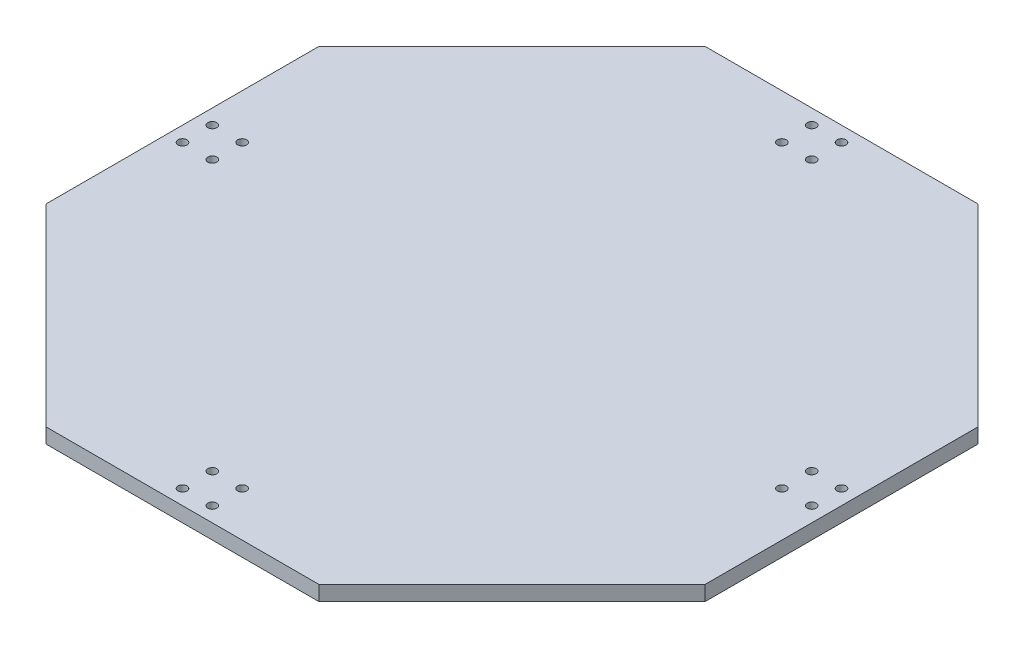
ISO-10303-21;
HEADER;
FILE_DESCRIPTION(('STEP AP214'),'2;1');
FILE_NAME('part.step','',(''),(''),'','','');
FILE_SCHEMA(('AUTOMOTIVE_DESIGN { 1 0 10303 214 1 1 1 1 }'));
ENDSEC;
DATA;
#1=APPLICATION_CONTEXT('core data for automotive mechanical design processes');
#2=APPLICATION_PROTOCOL_DEFINITION('international standard','automotive_design',2000,#1);
#3=PRODUCT_CONTEXT('',#1,'mechanical');
#4=PRODUCT('Part','Part','',(#3));
#5=PRODUCT_RELATED_PRODUCT_CATEGORY('part','',(#4));
#6=PRODUCT_DEFINITION_FORMATION('','',#4);
#7=PRODUCT_DEFINITION_CONTEXT('part definition',#1,'design');
#8=PRODUCT_DEFINITION('design','',#6,#7);
#9=PRODUCT_DEFINITION_SHAPE('','',#8);
#10=(LENGTH_UNIT() NAMED_UNIT(*) SI_UNIT(.MILLI.,.METRE.));
#11=(NAMED_UNIT(*) PLANE_ANGLE_UNIT() SI_UNIT($,.RADIAN.));
#12=(NAMED_UNIT(*) SI_UNIT($,.STERADIAN.) SOLID_ANGLE_UNIT());
#13=UNCERTAINTY_MEASURE_WITH_UNIT(LENGTH_MEASURE(1.E-05),#10,'distance_accuracy_value','');
#14=(GEOMETRIC_REPRESENTATION_CONTEXT(3) GLOBAL_UNCERTAINTY_ASSIGNED_CONTEXT((#13)) GLOBAL_UNIT_ASSIGNED_CONTEXT((#10,
#11,#12)) REPRESENTATION_CONTEXT('',''));
#15=CARTESIAN_POINT('',(0.,0.,0.));
#16=DIRECTION('',(0.,0.,1.));
#17=DIRECTION('',(1.,0.,0.));
#18=AXIS2_PLACEMENT_3D('',#15,#16,#17);
#19=CARTESIAN_POINT('',(0.,5.,0.));
#20=DIRECTION('',(0.,1.,0.));
#21=DIRECTION('',(0.,0.,1.));
#22=AXIS2_PLACEMENT_3D('',#19,#20,#21);
#23=PLANE('',#22);
#24=CARTESIAN_POINT('',(-95.4999999999973,5.,-4.99999999999745));
#25=DIRECTION('',(0.,1.,0.));
#26=DIRECTION('',(0.,0.,-1.));
#27=AXIS2_PLACEMENT_3D('',#24,#25,#26);
#28=CIRCLE('',#27,1.5);
#29=CARTESIAN_POINT('',(-95.4999999999973,5.,-6.49999999999744));
#30=VERTEX_POINT('',#29);
#31=EDGE_CURVE('E260',#30,#30,#28,.T.);
#32=ORIENTED_EDGE('',*,*,#31,.F.);
#33=EDGE_LOOP('',(#32));
#34=FACE_BOUND('',#33,.T.);
#35=CARTESIAN_POINT('',(-105.499999999997,5.,5.00000000000254));
#36=DIRECTION('',(0.,1.,0.));
#37=DIRECTION('',(0.,0.,1.));
#38=AXIS2_PLACEMENT_3D('',#35,#36,#37);
#39=CIRCLE('',#38,1.5);
#40=CARTESIAN_POINT('',(-105.499999999997,5.,6.50000000000254));
#41=VERTEX_POINT('',#40);
#42=EDGE_CURVE('E248',#41,#41,#39,.T.);
#43=ORIENTED_EDGE('',*,*,#42,.F.);
#44=EDGE_LOOP('',(#43));
#45=FACE_BOUND('',#44,.T.);
#46=CARTESIAN_POINT('',(-4.99999999999469,5.,95.4999999999998));
#47=DIRECTION('',(0.,1.,0.));
#48=DIRECTION('',(0.,0.,-1.));
#49=AXIS2_PLACEMENT_3D('',#46,#47,#48);
#50=CIRCLE('',#49,1.5);
#51=CARTESIAN_POINT('',(-4.99999999999469,5.,93.9999999999998));
#52=VERTEX_POINT('',#51);
#53=EDGE_CURVE('E236',#52,#52,#50,.T.);
#54=ORIENTED_EDGE('',*,*,#53,.F.);
#55=EDGE_LOOP('',(#54));
#56=FACE_BOUND('',#55,.T.);
#57=CARTESIAN_POINT('',(5.0000000000053,5.,105.5));
#58=DIRECTION('',(0.,1.,0.));
#59=DIRECTION('',(0.,0.,1.));
#60=AXIS2_PLACEMENT_3D('',#57,#58,#59);
#61=CIRCLE('',#60,1.50000000000001);
#62=CARTESIAN_POINT('',(5.0000000000053,5.,107.));
#63=VERTEX_POINT('',#62);
#64=EDGE_CURVE('E224',#63,#63,#61,.T.);
#65=ORIENTED_EDGE('',*,*,#64,.F.);
#66=EDGE_LOOP('',(#65));
#67=FACE_BOUND('',#66,.T.);
#68=CARTESIAN_POINT('',(95.5000000000026,5.,4.99999999999724));
#69=DIRECTION('',(0.,1.,0.));
#70=DIRECTION('',(0.,0.,-1.));
#71=AXIS2_PLACEMENT_3D('',#68,#69,#70);
#72=CIRCLE('',#71,1.5);
#73=CARTESIAN_POINT('',(95.5000000000026,5.,3.49999999999724));
#74=VERTEX_POINT('',#73);
#75=EDGE_CURVE('E212',#74,#74,#72,.T.);
#76=ORIENTED_EDGE('',*,*,#75,.F.);
#77=EDGE_LOOP('',(#76));
#78=FACE_BOUND('',#77,.T.);
#79=CARTESIAN_POINT('',(105.500000000003,5.,-5.00000000000275));
#80=DIRECTION('',(0.,1.,0.));
#81=DIRECTION('',(0.,0.,1.));
#82=AXIS2_PLACEMENT_3D('',#79,#80,#81);
#83=CIRCLE('',#82,1.5);
#84=CARTESIAN_POINT('',(105.500000000003,5.,-3.50000000000275));
#85=VERTEX_POINT('',#84);
#86=EDGE_CURVE('E200',#85,#85,#83,.T.);
#87=ORIENTED_EDGE('',*,*,#86,.F.);
#88=EDGE_LOOP('',(#87));
#89=FACE_BOUND('',#88,.T.);
#90=CARTESIAN_POINT('',(5.00000000000001,5.,-95.5));
#91=DIRECTION('',(0.,1.,0.));
#92=DIRECTION('',(0.,0.,-1.));
#93=AXIS2_PLACEMENT_3D('',#90,#91,#92);
#94=CIRCLE('',#93,1.5);
#95=CARTESIAN_POINT('',(5.00000000000001,5.,-97.));
#96=VERTEX_POINT('',#95);
#97=EDGE_CURVE('E188',#96,#96,#94,.T.);
#98=ORIENTED_EDGE('',*,*,#97,.F.);
#99=EDGE_LOOP('',(#98));
#100=FACE_BOUND('',#99,.T.);
#101=CARTESIAN_POINT('',(-4.99999999999998,5.,-105.5));
#102=DIRECTION('',(0.,1.,0.));
#103=DIRECTION('',(0.,0.,1.));
#104=AXIS2_PLACEMENT_3D('',#101,#102,#103);
#105=CIRCLE('',#104,1.5);
#106=CARTESIAN_POINT('',(-4.99999999999998,5.,-104.));
#107=VERTEX_POINT('',#106);
#108=EDGE_CURVE('E134',#107,#107,#105,.T.);
#109=ORIENTED_EDGE('',*,*,#108,.F.);
#110=EDGE_LOOP('',(#109));
#111=FACE_BOUND('',#110,.T.);
#112=DIRECTION('',(1.,0.,0.));
#113=VECTOR('',#112,1.);
#114=CARTESIAN_POINT('',(-45.770598642227,5.,110.5));
#115=LINE('',#114,#113);
#116=CARTESIAN_POINT('',(-45.770598642227,5.,110.5));
#117=VERTEX_POINT('',#116);
#118=CARTESIAN_POINT('',(45.7705986422271,5.,110.5));
#119=VERTEX_POINT('',#118);
#120=EDGE_CURVE('E145',#117,#119,#115,.T.);
#121=ORIENTED_EDGE('',*,*,#120,.T.);
#122=DIRECTION('',(0.707106781186547,0.,-0.707106781186548));
#123=VECTOR('',#122,1.);
#124=CARTESIAN_POINT('',(45.7705986422271,5.,110.5));
#125=LINE('',#124,#123);
#126=CARTESIAN_POINT('',(110.5,5.,45.770598642227));
#127=VERTEX_POINT('',#126);
#128=EDGE_CURVE('E93',#119,#127,#125,.T.);
#129=ORIENTED_EDGE('',*,*,#128,.T.);
#130=DIRECTION('',(0.,0.,-1.));
#131=VECTOR('',#130,1.);
#132=CARTESIAN_POINT('',(110.5,5.,45.770598642227));
#133=LINE('',#132,#131);
#134=CARTESIAN_POINT('',(110.5,5.,-45.7705986422271));
#135=VERTEX_POINT('',#134);
#136=EDGE_CURVE('E160',#127,#135,#133,.T.);
#137=ORIENTED_EDGE('',*,*,#136,.T.);
#138=DIRECTION('',(-0.707106781186547,0.,-0.707106781186547));
#139=VECTOR('',#138,1.);
#140=CARTESIAN_POINT('',(110.5,5.,-45.7705986422271));
#141=LINE('',#140,#139);
#142=CARTESIAN_POINT('',(45.770598642227,5.,-110.5));
#143=VERTEX_POINT('',#142);
#144=EDGE_CURVE('E173',#135,#143,#141,.T.);
#145=ORIENTED_EDGE('',*,*,#144,.T.);
#146=DIRECTION('',(-1.,0.,0.));
#147=VECTOR('',#146,1.);
#148=CARTESIAN_POINT('',(45.770598642227,5.,-110.5));
#149=LINE('',#148,#147);
#150=CARTESIAN_POINT('',(-45.770598642227,5.,-110.5));
#151=VERTEX_POINT('',#150);
#152=EDGE_CURVE('E112',#143,#151,#149,.T.);
#153=ORIENTED_EDGE('',*,*,#152,.T.);
#154=DIRECTION('',(-0.707106781186547,0.,0.707106781186548));
#155=VECTOR('',#154,1.);
#156=CARTESIAN_POINT('',(-45.770598642227,5.,-110.5));
#157=LINE('',#156,#155);
#158=CARTESIAN_POINT('',(-110.5,5.,-45.7705986422271));
#159=VERTEX_POINT('',#158);
#160=EDGE_CURVE('E106',#151,#159,#157,.T.);
#161=ORIENTED_EDGE('',*,*,#160,.T.);
#162=DIRECTION('',(0.,0.,1.));
#163=VECTOR('',#162,1.);
#164=CARTESIAN_POINT('',(-110.5,5.,-45.7705986422271));
#165=LINE('',#164,#163);
#166=CARTESIAN_POINT('',(-110.5,5.,45.770598642227));
#167=VERTEX_POINT('',#166);
#168=EDGE_CURVE('E110',#159,#167,#165,.T.);
#169=ORIENTED_EDGE('',*,*,#168,.T.);
#170=DIRECTION('',(0.707106781186546,0.,0.707106781186549));
#171=VECTOR('',#170,1.);
#172=CARTESIAN_POINT('',(-110.5,5.,45.770598642227));
#173=LINE('',#172,#171);
#174=EDGE_CURVE('E50',#167,#117,#173,.T.);
#175=ORIENTED_EDGE('',*,*,#174,.T.);
#176=EDGE_LOOP('',(#121,#129,#137,#145,#153,#161,#169,#175));
#177=FACE_BOUND('',#176,.T.);
#178=CARTESIAN_POINT('',(-4.99999999999996,5.,-95.5));
#179=DIRECTION('',(0.,1.,0.));
#180=DIRECTION('',(0.,0.,1.));
#181=AXIS2_PLACEMENT_3D('',#178,#179,#180);
#182=CIRCLE('',#181,1.49999999999997);
#183=CARTESIAN_POINT('',(-4.99999999999996,5.,-94.));
#184=VERTEX_POINT('',#183);
#185=EDGE_CURVE('E182',#184,#184,#182,.T.);
#186=ORIENTED_EDGE('',*,*,#185,.F.);
#187=EDGE_LOOP('',(#186));
#188=FACE_BOUND('',#187,.T.);
#189=CARTESIAN_POINT('',(5.00000000000002,5.,-105.5));
#190=DIRECTION('',(0.,1.,0.));
#191=DIRECTION('',(0.,0.,-1.));
#192=AXIS2_PLACEMENT_3D('',#189,#190,#191);
#193=CIRCLE('',#192,1.5);
#194=CARTESIAN_POINT('',(5.00000000000002,5.,-107.));
#195=VERTEX_POINT('',#194);
#196=EDGE_CURVE('E194',#195,#195,#193,.T.);
#197=ORIENTED_EDGE('',*,*,#196,.F.);
#198=EDGE_LOOP('',(#197));
#199=FACE_BOUND('',#198,.T.);
#200=CARTESIAN_POINT('',(95.5000000000026,5.,-5.00000000000273));
#201=DIRECTION('',(0.,1.,0.));
#202=DIRECTION('',(0.,0.,1.));
#203=AXIS2_PLACEMENT_3D('',#200,#201,#202);
#204=CIRCLE('',#203,1.5);
#205=CARTESIAN_POINT('',(95.5000000000026,5.,-3.50000000000274));
#206=VERTEX_POINT('',#205);
#207=EDGE_CURVE('E206',#206,#206,#204,.T.);
#208=ORIENTED_EDGE('',*,*,#207,.F.);
#209=EDGE_LOOP('',(#208));
#210=FACE_BOUND('',#209,.T.);
#211=CARTESIAN_POINT('',(105.500000000003,5.,4.99999999999725));
#212=DIRECTION('',(0.,1.,0.));
#213=DIRECTION('',(0.,0.,-1.));
#214=AXIS2_PLACEMENT_3D('',#211,#212,#213);
#215=CIRCLE('',#214,1.5);
#216=CARTESIAN_POINT('',(105.500000000003,5.,3.49999999999725));
#217=VERTEX_POINT('',#216);
#218=EDGE_CURVE('E218',#217,#217,#215,.T.);
#219=ORIENTED_EDGE('',*,*,#218,.F.);
#220=EDGE_LOOP('',(#219));
#221=FACE_BOUND('',#220,.T.);
#222=CARTESIAN_POINT('',(5.00000000000528,5.,95.4999999999998));
#223=DIRECTION('',(0.,1.,0.));
#224=DIRECTION('',(0.,0.,1.));
#225=AXIS2_PLACEMENT_3D('',#222,#223,#224);
#226=CIRCLE('',#225,1.5);
#227=CARTESIAN_POINT('',(5.00000000000528,5.,96.9999999999998));
#228=VERTEX_POINT('',#227);
#229=EDGE_CURVE('E230',#228,#228,#226,.T.);
#230=ORIENTED_EDGE('',*,*,#229,.F.);
#231=EDGE_LOOP('',(#230));
#232=FACE_BOUND('',#231,.T.);
#233=CARTESIAN_POINT('',(-4.9999999999947,5.,105.5));
#234=DIRECTION('',(0.,1.,0.));
#235=DIRECTION('',(0.,0.,-1.));
#236=AXIS2_PLACEMENT_3D('',#233,#234,#235);
#237=CIRCLE('',#236,1.5);
#238=CARTESIAN_POINT('',(-4.9999999999947,5.,104.));
#239=VERTEX_POINT('',#238);
#240=EDGE_CURVE('E242',#239,#239,#237,.T.);
#241=ORIENTED_EDGE('',*,*,#240,.F.);
#242=EDGE_LOOP('',(#241));
#243=FACE_BOUND('',#242,.T.);
#244=CARTESIAN_POINT('',(-95.4999999999973,5.,5.00000000000252));
#245=DIRECTION('',(0.,1.,0.));
#246=DIRECTION('',(0.,0.,1.));
#247=AXIS2_PLACEMENT_3D('',#244,#245,#246);
#248=CIRCLE('',#247,1.5);
#249=CARTESIAN_POINT('',(-95.4999999999973,5.,6.50000000000252));
#250=VERTEX_POINT('',#249);
#251=EDGE_CURVE('E254',#250,#250,#248,.T.);
#252=ORIENTED_EDGE('',*,*,#251,.F.);
#253=EDGE_LOOP('',(#252));
#254=FACE_BOUND('',#253,.T.);
#255=CARTESIAN_POINT('',(-105.499999999997,5.,-4.99999999999746));
#256=DIRECTION('',(0.,1.,0.));
#257=DIRECTION('',(0.,0.,-1.));
#258=AXIS2_PLACEMENT_3D('',#255,#256,#257);
#259=CIRCLE('',#258,1.5);
#260=CARTESIAN_POINT('',(-105.499999999997,5.,-6.49999999999746));
#261=VERTEX_POINT('',#260);
#262=EDGE_CURVE('E266',#261,#261,#259,.T.);
#263=ORIENTED_EDGE('',*,*,#262,.F.);
#264=EDGE_LOOP('',(#263));
#265=FACE_BOUND('',#264,.T.);
#266=ADVANCED_FACE('F33',(#34,#45,#56,#67,#78,#89,#100,#111,#177,#188,#199,#210,#221,#232,#243,
#254,#265),#23,.T.);
#267=CARTESIAN_POINT('',(0.,0.,0.));
#268=DIRECTION('',(0.,1.,0.));
#269=DIRECTION('',(0.,0.,1.));
#270=AXIS2_PLACEMENT_3D('',#267,#268,#269);
#271=PLANE('',#270);
#272=DIRECTION('',(1.,0.,0.));
#273=VECTOR('',#272,1.);
#274=CARTESIAN_POINT('',(-45.770598642227,0.,110.5));
#275=LINE('',#274,#273);
#276=CARTESIAN_POINT('',(-45.770598642227,0.,110.5));
#277=VERTEX_POINT('',#276);
#278=CARTESIAN_POINT('',(45.7705986422271,0.,110.5));
#279=VERTEX_POINT('',#278);
#280=EDGE_CURVE('E130',#277,#279,#275,.T.);
#281=ORIENTED_EDGE('',*,*,#280,.F.);
#282=DIRECTION('',(0.707106781186546,0.,0.707106781186549));
#283=VECTOR('',#282,1.);
#284=CARTESIAN_POINT('',(-110.5,0.,45.770598642227));
#285=LINE('',#284,#283);
#286=CARTESIAN_POINT('',(-110.5,0.,45.770598642227));
#287=VERTEX_POINT('',#286);
#288=EDGE_CURVE('E85',#287,#277,#285,.T.);
#289=ORIENTED_EDGE('',*,*,#288,.F.);
#290=DIRECTION('',(0.,0.,1.));
#291=VECTOR('',#290,1.);
#292=CARTESIAN_POINT('',(-110.5,0.,-45.7705986422271));
#293=LINE('',#292,#291);
#294=CARTESIAN_POINT('',(-110.5,0.,-45.7705986422271));
#295=VERTEX_POINT('',#294);
#296=EDGE_CURVE('E79',#295,#287,#293,.T.);
#297=ORIENTED_EDGE('',*,*,#296,.F.);
#298=DIRECTION('',(-0.707106781186547,0.,0.707106781186548));
#299=VECTOR('',#298,1.);
#300=CARTESIAN_POINT('',(-45.770598642227,0.,-110.5));
#301=LINE('',#300,#299);
#302=CARTESIAN_POINT('',(-45.770598642227,0.,-110.5));
#303=VERTEX_POINT('',#302);
#304=EDGE_CURVE('E120',#303,#295,#301,.T.);
#305=ORIENTED_EDGE('',*,*,#304,.F.);
#306=DIRECTION('',(-1.,0.,0.));
#307=VECTOR('',#306,1.);
#308=CARTESIAN_POINT('',(45.770598642227,0.,-110.5));
#309=LINE('',#308,#307);
#310=CARTESIAN_POINT('',(45.770598642227,0.,-110.5));
#311=VERTEX_POINT('',#310);
#312=EDGE_CURVE('E140',#311,#303,#309,.T.);
#313=ORIENTED_EDGE('',*,*,#312,.F.);
#314=DIRECTION('',(-0.707106781186547,0.,-0.707106781186547));
#315=VECTOR('',#314,1.);
#316=CARTESIAN_POINT('',(110.5,0.,-45.7705986422271));
#317=LINE('',#316,#315);
#318=CARTESIAN_POINT('',(110.5,0.,-45.7705986422271));
#319=VERTEX_POINT('',#318);
#320=EDGE_CURVE('E138',#319,#311,#317,.T.);
#321=ORIENTED_EDGE('',*,*,#320,.F.);
#322=DIRECTION('',(0.,0.,-1.));
#323=VECTOR('',#322,1.);
#324=CARTESIAN_POINT('',(110.5,0.,45.770598642227));
#325=LINE('',#324,#323);
#326=CARTESIAN_POINT('',(110.5,0.,45.770598642227));
#327=VERTEX_POINT('',#326);
#328=EDGE_CURVE('E136',#327,#319,#325,.T.);
#329=ORIENTED_EDGE('',*,*,#328,.F.);
#330=DIRECTION('',(0.707106781186547,0.,-0.707106781186548));
#331=VECTOR('',#330,1.);
#332=CARTESIAN_POINT('',(45.7705986422271,0.,110.5));
#333=LINE('',#332,#331);
#334=EDGE_CURVE('E133',#279,#327,#333,.T.);
#335=ORIENTED_EDGE('',*,*,#334,.F.);
#336=EDGE_LOOP('',(#281,#289,#297,#305,#313,#321,#329,#335));
#337=FACE_BOUND('',#336,.T.);
#338=CARTESIAN_POINT('',(-4.99999999999998,0.,-105.5));
#339=DIRECTION('',(0.,1.,0.));
#340=DIRECTION('',(0.,0.,1.));
#341=AXIS2_PLACEMENT_3D('',#338,#339,#340);
#342=CIRCLE('',#341,1.5);
#343=CARTESIAN_POINT('',(-4.99999999999998,0.,-104.));
#344=VERTEX_POINT('',#343);
#345=EDGE_CURVE('E179',#344,#344,#342,.T.);
#346=ORIENTED_EDGE('',*,*,#345,.T.);
#347=EDGE_LOOP('',(#346));
#348=FACE_BOUND('',#347,.T.);
#349=CARTESIAN_POINT('',(-4.99999999999996,0.,-95.5));
#350=DIRECTION('',(0.,1.,0.));
#351=DIRECTION('',(0.,0.,1.));
#352=AXIS2_PLACEMENT_3D('',#349,#350,#351);
#353=CIRCLE('',#352,1.49999999999997);
#354=CARTESIAN_POINT('',(-4.99999999999996,0.,-94.));
#355=VERTEX_POINT('',#354);
#356=EDGE_CURVE('E185',#355,#355,#353,.T.);
#357=ORIENTED_EDGE('',*,*,#356,.T.);
#358=EDGE_LOOP('',(#357));
#359=FACE_BOUND('',#358,.T.);
#360=CARTESIAN_POINT('',(5.00000000000001,0.,-95.5));
#361=DIRECTION('',(0.,1.,0.));
#362=DIRECTION('',(0.,0.,-1.));
#363=AXIS2_PLACEMENT_3D('',#360,#361,#362);
#364=CIRCLE('',#363,1.5);
#365=CARTESIAN_POINT('',(5.00000000000001,0.,-97.));
#366=VERTEX_POINT('',#365);
#367=EDGE_CURVE('E191',#366,#366,#364,.T.);
#368=ORIENTED_EDGE('',*,*,#367,.T.);
#369=EDGE_LOOP('',(#368));
#370=FACE_BOUND('',#369,.T.);
#371=CARTESIAN_POINT('',(5.00000000000002,0.,-105.5));
#372=DIRECTION('',(0.,1.,0.));
#373=DIRECTION('',(0.,0.,-1.));
#374=AXIS2_PLACEMENT_3D('',#371,#372,#373);
#375=CIRCLE('',#374,1.5);
#376=CARTESIAN_POINT('',(5.00000000000002,0.,-107.));
#377=VERTEX_POINT('',#376);
#378=EDGE_CURVE('E197',#377,#377,#375,.T.);
#379=ORIENTED_EDGE('',*,*,#378,.T.);
#380=EDGE_LOOP('',(#379));
#381=FACE_BOUND('',#380,.T.);
#382=CARTESIAN_POINT('',(105.500000000003,0.,-5.00000000000275));
#383=DIRECTION('',(0.,1.,0.));
#384=DIRECTION('',(0.,0.,1.));
#385=AXIS2_PLACEMENT_3D('',#382,#383,#384);
#386=CIRCLE('',#385,1.5);
#387=CARTESIAN_POINT('',(105.500000000003,0.,-3.50000000000275));
#388=VERTEX_POINT('',#387);
#389=EDGE_CURVE('E203',#388,#388,#386,.T.);
#390=ORIENTED_EDGE('',*,*,#389,.T.);
#391=EDGE_LOOP('',(#390));
#392=FACE_BOUND('',#391,.T.);
#393=CARTESIAN_POINT('',(95.5000000000026,0.,-5.00000000000273));
#394=DIRECTION('',(0.,1.,0.));
#395=DIRECTION('',(0.,0.,1.));
#396=AXIS2_PLACEMENT_3D('',#393,#394,#395);
#397=CIRCLE('',#396,1.5);
#398=CARTESIAN_POINT('',(95.5000000000026,0.,-3.50000000000274));
#399=VERTEX_POINT('',#398);
#400=EDGE_CURVE('E209',#399,#399,#397,.T.);
#401=ORIENTED_EDGE('',*,*,#400,.T.);
#402=EDGE_LOOP('',(#401));
#403=FACE_BOUND('',#402,.T.);
#404=CARTESIAN_POINT('',(95.5000000000026,0.,4.99999999999724));
#405=DIRECTION('',(0.,1.,0.));
#406=DIRECTION('',(0.,0.,-1.));
#407=AXIS2_PLACEMENT_3D('',#404,#405,#406);
#408=CIRCLE('',#407,1.5);
#409=CARTESIAN_POINT('',(95.5000000000026,0.,3.49999999999724));
#410=VERTEX_POINT('',#409);
#411=EDGE_CURVE('E215',#410,#410,#408,.T.);
#412=ORIENTED_EDGE('',*,*,#411,.T.);
#413=EDGE_LOOP('',(#412));
#414=FACE_BOUND('',#413,.T.);
#415=CARTESIAN_POINT('',(105.500000000003,0.,4.99999999999725));
#416=DIRECTION('',(0.,1.,0.));
#417=DIRECTION('',(0.,0.,-1.));
#418=AXIS2_PLACEMENT_3D('',#415,#416,#417);
#419=CIRCLE('',#418,1.5);
#420=CARTESIAN_POINT('',(105.500000000003,0.,3.49999999999725));
#421=VERTEX_POINT('',#420);
#422=EDGE_CURVE('E221',#421,#421,#419,.T.);
#423=ORIENTED_EDGE('',*,*,#422,.T.);
#424=EDGE_LOOP('',(#423));
#425=FACE_BOUND('',#424,.T.);
#426=CARTESIAN_POINT('',(5.0000000000053,0.,105.5));
#427=DIRECTION('',(0.,1.,0.));
#428=DIRECTION('',(0.,0.,1.));
#429=AXIS2_PLACEMENT_3D('',#426,#427,#428);
#430=CIRCLE('',#429,1.50000000000001);
#431=CARTESIAN_POINT('',(5.0000000000053,0.,107.));
#432=VERTEX_POINT('',#431);
#433=EDGE_CURVE('E227',#432,#432,#430,.T.);
#434=ORIENTED_EDGE('',*,*,#433,.T.);
#435=EDGE_LOOP('',(#434));
#436=FACE_BOUND('',#435,.T.);
#437=CARTESIAN_POINT('',(5.00000000000528,0.,95.4999999999998));
#438=DIRECTION('',(0.,1.,0.));
#439=DIRECTION('',(0.,0.,1.));
#440=AXIS2_PLACEMENT_3D('',#437,#438,#439);
#441=CIRCLE('',#440,1.5);
#442=CARTESIAN_POINT('',(5.00000000000528,0.,96.9999999999998));
#443=VERTEX_POINT('',#442);
#444=EDGE_CURVE('E233',#443,#443,#441,.T.);
#445=ORIENTED_EDGE('',*,*,#444,.T.);
#446=EDGE_LOOP('',(#445));
#447=FACE_BOUND('',#446,.T.);
#448=CARTESIAN_POINT('',(-4.99999999999469,0.,95.4999999999998));
#449=DIRECTION('',(0.,1.,0.));
#450=DIRECTION('',(0.,0.,-1.));
#451=AXIS2_PLACEMENT_3D('',#448,#449,#450);
#452=CIRCLE('',#451,1.5);
#453=CARTESIAN_POINT('',(-4.99999999999469,0.,93.9999999999998));
#454=VERTEX_POINT('',#453);
#455=EDGE_CURVE('E239',#454,#454,#452,.T.);
#456=ORIENTED_EDGE('',*,*,#455,.T.);
#457=EDGE_LOOP('',(#456));
#458=FACE_BOUND('',#457,.T.);
#459=CARTESIAN_POINT('',(-4.9999999999947,0.,105.5));
#460=DIRECTION('',(0.,1.,0.));
#461=DIRECTION('',(0.,0.,-1.));
#462=AXIS2_PLACEMENT_3D('',#459,#460,#461);
#463=CIRCLE('',#462,1.5);
#464=CARTESIAN_POINT('',(-4.9999999999947,0.,104.));
#465=VERTEX_POINT('',#464);
#466=EDGE_CURVE('E245',#465,#465,#463,.T.);
#467=ORIENTED_EDGE('',*,*,#466,.T.);
#468=EDGE_LOOP('',(#467));
#469=FACE_BOUND('',#468,.T.);
#470=CARTESIAN_POINT('',(-105.499999999997,0.,5.00000000000254));
#471=DIRECTION('',(0.,1.,0.));
#472=DIRECTION('',(0.,0.,1.));
#473=AXIS2_PLACEMENT_3D('',#470,#471,#472);
#474=CIRCLE('',#473,1.5);
#475=CARTESIAN_POINT('',(-105.499999999997,0.,6.50000000000254));
#476=VERTEX_POINT('',#475);
#477=EDGE_CURVE('E251',#476,#476,#474,.T.);
#478=ORIENTED_EDGE('',*,*,#477,.T.);
#479=EDGE_LOOP('',(#478));
#480=FACE_BOUND('',#479,.T.);
#481=CARTESIAN_POINT('',(-95.4999999999973,0.,5.00000000000252));
#482=DIRECTION('',(0.,1.,0.));
#483=DIRECTION('',(0.,0.,1.));
#484=AXIS2_PLACEMENT_3D('',#481,#482,#483);
#485=CIRCLE('',#484,1.5);
#486=CARTESIAN_POINT('',(-95.4999999999973,0.,6.50000000000252));
#487=VERTEX_POINT('',#486);
#488=EDGE_CURVE('E257',#487,#487,#485,.T.);
#489=ORIENTED_EDGE('',*,*,#488,.T.);
#490=EDGE_LOOP('',(#489));
#491=FACE_BOUND('',#490,.T.);
#492=CARTESIAN_POINT('',(-95.4999999999973,0.,-4.99999999999745));
#493=DIRECTION('',(0.,1.,0.));
#494=DIRECTION('',(0.,0.,-1.));
#495=AXIS2_PLACEMENT_3D('',#492,#493,#494);
#496=CIRCLE('',#495,1.5);
#497=CARTESIAN_POINT('',(-95.4999999999973,0.,-6.49999999999744));
#498=VERTEX_POINT('',#497);
#499=EDGE_CURVE('E263',#498,#498,#496,.T.);
#500=ORIENTED_EDGE('',*,*,#499,.T.);
#501=EDGE_LOOP('',(#500));
#502=FACE_BOUND('',#501,.T.);
#503=CARTESIAN_POINT('',(-105.499999999997,0.,-4.99999999999746));
#504=DIRECTION('',(0.,1.,0.));
#505=DIRECTION('',(0.,0.,-1.));
#506=AXIS2_PLACEMENT_3D('',#503,#504,#505);
#507=CIRCLE('',#506,1.5);
#508=CARTESIAN_POINT('',(-105.499999999997,0.,-6.49999999999746));
#509=VERTEX_POINT('',#508);
#510=EDGE_CURVE('E269',#509,#509,#507,.T.);
#511=ORIENTED_EDGE('',*,*,#510,.T.);
#512=EDGE_LOOP('',(#511));
#513=FACE_BOUND('',#512,.T.);
#514=ADVANCED_FACE('F164',(#337,#348,#359,#370,#381,#392,#403,#414,#425,#436,#447,#458,#469,
#480,#491,#502,#513),#271,.F.);
#515=CARTESIAN_POINT('',(-45.770598642227,5.,110.5));
#516=DIRECTION('',(0.,0.,-1.));
#517=DIRECTION('',(-1.,0.,0.));
#518=AXIS2_PLACEMENT_3D('',#515,#516,#517);
#519=PLANE('',#518);
#520=ORIENTED_EDGE('',*,*,#280,.T.);
#521=DIRECTION('',(0.,-1.,0.));
#522=VECTOR('',#521,1.);
#523=CARTESIAN_POINT('',(45.7705986422271,5.,110.5));
#524=LINE('',#523,#522);
#525=EDGE_CURVE('E11',#119,#279,#524,.T.);
#526=ORIENTED_EDGE('',*,*,#525,.F.);
#527=ORIENTED_EDGE('',*,*,#120,.F.);
#528=DIRECTION('',(0.,-1.,0.));
#529=VECTOR('',#528,1.);
#530=CARTESIAN_POINT('',(-45.770598642227,5.,110.5));
#531=LINE('',#530,#529);
#532=EDGE_CURVE('E126',#117,#277,#531,.T.);
#533=ORIENTED_EDGE('',*,*,#532,.T.);
#534=EDGE_LOOP('',(#520,#526,#527,#533));
#535=FACE_BOUND('',#534,.T.);
#536=ADVANCED_FACE('F35',(#535),#519,.F.);
#537=CARTESIAN_POINT('',(45.7705986422271,5.,110.5));
#538=DIRECTION('',(-0.707106781186548,0.,-0.707106781186547));
#539=DIRECTION('',(-0.707106781186547,0.,0.707106781186548));
#540=AXIS2_PLACEMENT_3D('',#537,#538,#539);
#541=PLANE('',#540);
#542=ORIENTED_EDGE('',*,*,#334,.T.);
#543=DIRECTION('',(0.,-1.,0.));
#544=VECTOR('',#543,1.);
#545=CARTESIAN_POINT('',(110.5,5.,45.770598642227));
#546=LINE('',#545,#544);
#547=EDGE_CURVE('E42',#127,#327,#546,.T.);
#548=ORIENTED_EDGE('',*,*,#547,.F.);
#549=ORIENTED_EDGE('',*,*,#128,.F.);
#550=ORIENTED_EDGE('',*,*,#525,.T.);
#551=EDGE_LOOP('',(#542,#548,#549,#550));
#552=FACE_BOUND('',#551,.T.);
#553=ADVANCED_FACE('F303',(#552),#541,.F.);
#554=CARTESIAN_POINT('',(110.5,5.,45.770598642227));
#555=DIRECTION('',(-1.,0.,0.));
#556=DIRECTION('',(0.,0.,1.));
#557=AXIS2_PLACEMENT_3D('',#554,#555,#556);
#558=PLANE('',#557);
#559=ORIENTED_EDGE('',*,*,#328,.T.);
#560=DIRECTION('',(0.,-1.,0.));
#561=VECTOR('',#560,1.);
#562=CARTESIAN_POINT('',(110.5,5.,-45.7705986422271));
#563=LINE('',#562,#561);
#564=EDGE_CURVE('E152',#135,#319,#563,.T.);
#565=ORIENTED_EDGE('',*,*,#564,.F.);
#566=ORIENTED_EDGE('',*,*,#136,.F.);
#567=ORIENTED_EDGE('',*,*,#547,.T.);
#568=EDGE_LOOP('',(#559,#565,#566,#567));
#569=FACE_BOUND('',#568,.T.);
#570=ADVANCED_FACE('F158',(#569),#558,.F.);
#571=CARTESIAN_POINT('',(110.5,5.,-45.7705986422271));
#572=DIRECTION('',(-0.707106781186548,0.,0.707106781186548));
#573=DIRECTION('',(0.707106781186548,0.,0.707106781186548));
#574=AXIS2_PLACEMENT_3D('',#571,#572,#573);
#575=PLANE('',#574);
#576=ORIENTED_EDGE('',*,*,#320,.T.);
#577=DIRECTION('',(0.,-1.,0.));
#578=VECTOR('',#577,1.);
#579=CARTESIAN_POINT('',(45.770598642227,5.,-110.5));
#580=LINE('',#579,#578);
#581=EDGE_CURVE('E149',#143,#311,#580,.T.);
#582=ORIENTED_EDGE('',*,*,#581,.F.);
#583=ORIENTED_EDGE('',*,*,#144,.F.);
#584=ORIENTED_EDGE('',*,*,#564,.T.);
#585=EDGE_LOOP('',(#576,#582,#583,#584));
#586=FACE_BOUND('',#585,.T.);
#587=ADVANCED_FACE('F169',(#586),#575,.F.);
#588=CARTESIAN_POINT('',(45.770598642227,5.,-110.5));
#589=DIRECTION('',(0.,0.,1.));
#590=DIRECTION('',(1.,0.,0.));
#591=AXIS2_PLACEMENT_3D('',#588,#589,#590);
#592=PLANE('',#591);
#593=ORIENTED_EDGE('',*,*,#312,.T.);
#594=DIRECTION('',(0.,-1.,0.));
#595=VECTOR('',#594,1.);
#596=CARTESIAN_POINT('',(-45.770598642227,5.,-110.5));
#597=LINE('',#596,#595);
#598=EDGE_CURVE('E121',#151,#303,#597,.T.);
#599=ORIENTED_EDGE('',*,*,#598,.F.);
#600=ORIENTED_EDGE('',*,*,#152,.F.);
#601=ORIENTED_EDGE('',*,*,#581,.T.);
#602=EDGE_LOOP('',(#593,#599,#600,#601));
#603=FACE_BOUND('',#602,.T.);
#604=ADVANCED_FACE('F172',(#603),#592,.F.);
#605=CARTESIAN_POINT('',(-45.770598642227,5.,-110.5));
#606=DIRECTION('',(0.707106781186548,0.,0.707106781186547));
#607=DIRECTION('',(0.707106781186547,0.,-0.707106781186548));
#608=AXIS2_PLACEMENT_3D('',#605,#606,#607);
#609=PLANE('',#608);
#610=ORIENTED_EDGE('',*,*,#304,.T.);
#611=DIRECTION('',(0.,-1.,0.));
#612=VECTOR('',#611,1.);
#613=CARTESIAN_POINT('',(-110.5,5.,-45.7705986422271));
#614=LINE('',#613,#612);
#615=EDGE_CURVE('E117',#159,#295,#614,.T.);
#616=ORIENTED_EDGE('',*,*,#615,.F.);
#617=ORIENTED_EDGE('',*,*,#160,.F.);
#618=ORIENTED_EDGE('',*,*,#598,.T.);
#619=EDGE_LOOP('',(#610,#616,#617,#618));
#620=FACE_BOUND('',#619,.T.);
#621=ADVANCED_FACE('F118',(#620),#609,.F.);
#622=CARTESIAN_POINT('',(-110.5,5.,-45.7705986422271));
#623=DIRECTION('',(1.,0.,0.));
#624=DIRECTION('',(0.,0.,-1.));
#625=AXIS2_PLACEMENT_3D('',#622,#623,#624);
#626=PLANE('',#625);
#627=ORIENTED_EDGE('',*,*,#296,.T.);
#628=DIRECTION('',(0.,-1.,0.));
#629=VECTOR('',#628,1.);
#630=CARTESIAN_POINT('',(-110.5,5.,45.770598642227));
#631=LINE('',#630,#629);
#632=EDGE_CURVE('E122',#167,#287,#631,.T.);
#633=ORIENTED_EDGE('',*,*,#632,.F.);
#634=ORIENTED_EDGE('',*,*,#168,.F.);
#635=ORIENTED_EDGE('',*,*,#615,.T.);
#636=EDGE_LOOP('',(#627,#633,#634,#635));
#637=FACE_BOUND('',#636,.T.);
#638=ADVANCED_FACE('F124',(#637),#626,.F.);
#639=CARTESIAN_POINT('',(-110.5,5.,45.770598642227));
#640=DIRECTION('',(0.707106781186549,0.,-0.707106781186546));
#641=DIRECTION('',(-0.707106781186546,0.,-0.707106781186549));
#642=AXIS2_PLACEMENT_3D('',#639,#640,#641);
#643=PLANE('',#642);
#644=ORIENTED_EDGE('',*,*,#288,.T.);
#645=ORIENTED_EDGE('',*,*,#532,.F.);
#646=ORIENTED_EDGE('',*,*,#174,.F.);
#647=ORIENTED_EDGE('',*,*,#632,.T.);
#648=EDGE_LOOP('',(#644,#645,#646,#647));
#649=FACE_BOUND('',#648,.T.);
#650=ADVANCED_FACE('F291',(#649),#643,.F.);
#651=CARTESIAN_POINT('',(-4.99999999999998,5.,-105.5));
#652=DIRECTION('',(0.,-1.,0.));
#653=DIRECTION('',(0.,0.,-1.));
#654=AXIS2_PLACEMENT_3D('',#651,#652,#653);
#655=CYLINDRICAL_SURFACE('',#654,1.5);
#656=ORIENTED_EDGE('',*,*,#108,.T.);
#657=EDGE_LOOP('',(#656));
#658=FACE_BOUND('',#657,.T.);
#659=ORIENTED_EDGE('',*,*,#345,.F.);
#660=EDGE_LOOP('',(#659));
#661=FACE_BOUND('',#660,.T.);
#662=ADVANCED_FACE('F288',(#658,#661),#655,.F.);
#663=CARTESIAN_POINT('',(-4.99999999999996,5.,-95.5));
#664=DIRECTION('',(0.,-1.,0.));
#665=DIRECTION('',(0.,0.,-1.));
#666=AXIS2_PLACEMENT_3D('',#663,#664,#665);
#667=CYLINDRICAL_SURFACE('',#666,1.49999999999997);
#668=ORIENTED_EDGE('',*,*,#185,.T.);
#669=EDGE_LOOP('',(#668));
#670=FACE_BOUND('',#669,.T.);
#671=ORIENTED_EDGE('',*,*,#356,.F.);
#672=EDGE_LOOP('',(#671));
#673=FACE_BOUND('',#672,.T.);
#674=ADVANCED_FACE('F367',(#670,#673),#667,.F.);
#675=CARTESIAN_POINT('',(5.00000000000001,5.,-95.5));
#676=DIRECTION('',(0.,-1.,0.));
#677=DIRECTION('',(0.,0.,-1.));
#678=AXIS2_PLACEMENT_3D('',#675,#676,#677);
#679=CYLINDRICAL_SURFACE('',#678,1.5);
#680=ORIENTED_EDGE('',*,*,#97,.T.);
#681=EDGE_LOOP('',(#680));
#682=FACE_BOUND('',#681,.T.);
#683=ORIENTED_EDGE('',*,*,#367,.F.);
#684=EDGE_LOOP('',(#683));
#685=FACE_BOUND('',#684,.T.);
#686=ADVANCED_FACE('F375',(#682,#685),#679,.F.);
#687=CARTESIAN_POINT('',(5.00000000000002,5.,-105.5));
#688=DIRECTION('',(0.,-1.,0.));
#689=DIRECTION('',(0.,0.,-1.));
#690=AXIS2_PLACEMENT_3D('',#687,#688,#689);
#691=CYLINDRICAL_SURFACE('',#690,1.5);
#692=ORIENTED_EDGE('',*,*,#196,.T.);
#693=EDGE_LOOP('',(#692));
#694=FACE_BOUND('',#693,.T.);
#695=ORIENTED_EDGE('',*,*,#378,.F.);
#696=EDGE_LOOP('',(#695));
#697=FACE_BOUND('',#696,.T.);
#698=ADVANCED_FACE('F383',(#694,#697),#691,.F.);
#699=CARTESIAN_POINT('',(105.500000000003,5.,-5.00000000000275));
#700=DIRECTION('',(0.,-1.,0.));
#701=DIRECTION('',(0.,0.,-1.));
#702=AXIS2_PLACEMENT_3D('',#699,#700,#701);
#703=CYLINDRICAL_SURFACE('',#702,1.5);
#704=ORIENTED_EDGE('',*,*,#86,.T.);
#705=EDGE_LOOP('',(#704));
#706=FACE_BOUND('',#705,.T.);
#707=ORIENTED_EDGE('',*,*,#389,.F.);
#708=EDGE_LOOP('',(#707));
#709=FACE_BOUND('',#708,.T.);
#710=ADVANCED_FACE('F392',(#706,#709),#703,.F.);
#711=CARTESIAN_POINT('',(95.5000000000026,5.,-5.00000000000273));
#712=DIRECTION('',(0.,-1.,0.));
#713=DIRECTION('',(0.,0.,-1.));
#714=AXIS2_PLACEMENT_3D('',#711,#712,#713);
#715=CYLINDRICAL_SURFACE('',#714,1.5);
#716=ORIENTED_EDGE('',*,*,#207,.T.);
#717=EDGE_LOOP('',(#716));
#718=FACE_BOUND('',#717,.T.);
#719=ORIENTED_EDGE('',*,*,#400,.F.);
#720=EDGE_LOOP('',(#719));
#721=FACE_BOUND('',#720,.T.);
#722=ADVANCED_FACE('F401',(#718,#721),#715,.F.);
#723=CARTESIAN_POINT('',(95.5000000000026,5.,4.99999999999724));
#724=DIRECTION('',(0.,-1.,0.));
#725=DIRECTION('',(0.,0.,-1.));
#726=AXIS2_PLACEMENT_3D('',#723,#724,#725);
#727=CYLINDRICAL_SURFACE('',#726,1.5);
#728=ORIENTED_EDGE('',*,*,#75,.T.);
#729=EDGE_LOOP('',(#728));
#730=FACE_BOUND('',#729,.T.);
#731=ORIENTED_EDGE('',*,*,#411,.F.);
#732=EDGE_LOOP('',(#731));
#733=FACE_BOUND('',#732,.T.);
#734=ADVANCED_FACE('F410',(#730,#733),#727,.F.);
#735=CARTESIAN_POINT('',(105.500000000003,5.,4.99999999999725));
#736=DIRECTION('',(0.,-1.,0.));
#737=DIRECTION('',(0.,0.,-1.));
#738=AXIS2_PLACEMENT_3D('',#735,#736,#737);
#739=CYLINDRICAL_SURFACE('',#738,1.5);
#740=ORIENTED_EDGE('',*,*,#218,.T.);
#741=EDGE_LOOP('',(#740));
#742=FACE_BOUND('',#741,.T.);
#743=ORIENTED_EDGE('',*,*,#422,.F.);
#744=EDGE_LOOP('',(#743));
#745=FACE_BOUND('',#744,.T.);
#746=ADVANCED_FACE('F419',(#742,#745),#739,.F.);
#747=CARTESIAN_POINT('',(5.0000000000053,5.,105.5));
#748=DIRECTION('',(0.,-1.,0.));
#749=DIRECTION('',(0.,0.,-1.));
#750=AXIS2_PLACEMENT_3D('',#747,#748,#749);
#751=CYLINDRICAL_SURFACE('',#750,1.50000000000001);
#752=ORIENTED_EDGE('',*,*,#64,.T.);
#753=EDGE_LOOP('',(#752));
#754=FACE_BOUND('',#753,.T.);
#755=ORIENTED_EDGE('',*,*,#433,.F.);
#756=EDGE_LOOP('',(#755));
#757=FACE_BOUND('',#756,.T.);
#758=ADVANCED_FACE('F428',(#754,#757),#751,.F.);
#759=CARTESIAN_POINT('',(5.00000000000528,5.,95.4999999999998));
#760=DIRECTION('',(0.,-1.,0.));
#761=DIRECTION('',(0.,0.,-1.));
#762=AXIS2_PLACEMENT_3D('',#759,#760,#761);
#763=CYLINDRICAL_SURFACE('',#762,1.5);
#764=ORIENTED_EDGE('',*,*,#229,.T.);
#765=EDGE_LOOP('',(#764));
#766=FACE_BOUND('',#765,.T.);
#767=ORIENTED_EDGE('',*,*,#444,.F.);
#768=EDGE_LOOP('',(#767));
#769=FACE_BOUND('',#768,.T.);
#770=ADVANCED_FACE('F437',(#766,#769),#763,.F.);
#771=CARTESIAN_POINT('',(-4.99999999999469,5.,95.4999999999998));
#772=DIRECTION('',(0.,-1.,0.));
#773=DIRECTION('',(0.,0.,-1.));
#774=AXIS2_PLACEMENT_3D('',#771,#772,#773);
#775=CYLINDRICAL_SURFACE('',#774,1.5);
#776=ORIENTED_EDGE('',*,*,#53,.T.);
#777=EDGE_LOOP('',(#776));
#778=FACE_BOUND('',#777,.T.);
#779=ORIENTED_EDGE('',*,*,#455,.F.);
#780=EDGE_LOOP('',(#779));
#781=FACE_BOUND('',#780,.T.);
#782=ADVANCED_FACE('F446',(#778,#781),#775,.F.);
#783=CARTESIAN_POINT('',(-4.9999999999947,5.,105.5));
#784=DIRECTION('',(0.,-1.,0.));
#785=DIRECTION('',(0.,0.,-1.));
#786=AXIS2_PLACEMENT_3D('',#783,#784,#785);
#787=CYLINDRICAL_SURFACE('',#786,1.5);
#788=ORIENTED_EDGE('',*,*,#240,.T.);
#789=EDGE_LOOP('',(#788));
#790=FACE_BOUND('',#789,.T.);
#791=ORIENTED_EDGE('',*,*,#466,.F.);
#792=EDGE_LOOP('',(#791));
#793=FACE_BOUND('',#792,.T.);
#794=ADVANCED_FACE('F455',(#790,#793),#787,.F.);
#795=CARTESIAN_POINT('',(-105.499999999997,5.,5.00000000000254));
#796=DIRECTION('',(0.,-1.,0.));
#797=DIRECTION('',(0.,0.,-1.));
#798=AXIS2_PLACEMENT_3D('',#795,#796,#797);
#799=CYLINDRICAL_SURFACE('',#798,1.5);
#800=ORIENTED_EDGE('',*,*,#42,.T.);
#801=EDGE_LOOP('',(#800));
#802=FACE_BOUND('',#801,.T.);
#803=ORIENTED_EDGE('',*,*,#477,.F.);
#804=EDGE_LOOP('',(#803));
#805=FACE_BOUND('',#804,.T.);
#806=ADVANCED_FACE('F464',(#802,#805),#799,.F.);
#807=CARTESIAN_POINT('',(-95.4999999999973,5.,5.00000000000252));
#808=DIRECTION('',(0.,-1.,0.));
#809=DIRECTION('',(0.,0.,-1.));
#810=AXIS2_PLACEMENT_3D('',#807,#808,#809);
#811=CYLINDRICAL_SURFACE('',#810,1.5);
#812=ORIENTED_EDGE('',*,*,#251,.T.);
#813=EDGE_LOOP('',(#812));
#814=FACE_BOUND('',#813,.T.);
#815=ORIENTED_EDGE('',*,*,#488,.F.);
#816=EDGE_LOOP('',(#815));
#817=FACE_BOUND('',#816,.T.);
#818=ADVANCED_FACE('F473',(#814,#817),#811,.F.);
#819=CARTESIAN_POINT('',(-95.4999999999973,5.,-4.99999999999745));
#820=DIRECTION('',(0.,-1.,0.));
#821=DIRECTION('',(0.,0.,-1.));
#822=AXIS2_PLACEMENT_3D('',#819,#820,#821);
#823=CYLINDRICAL_SURFACE('',#822,1.5);
#824=ORIENTED_EDGE('',*,*,#31,.T.);
#825=EDGE_LOOP('',(#824));
#826=FACE_BOUND('',#825,.T.);
#827=ORIENTED_EDGE('',*,*,#499,.F.);
#828=EDGE_LOOP('',(#827));
#829=FACE_BOUND('',#828,.T.);
#830=ADVANCED_FACE('F482',(#826,#829),#823,.F.);
#831=CARTESIAN_POINT('',(-105.499999999997,5.,-4.99999999999746));
#832=DIRECTION('',(0.,-1.,0.));
#833=DIRECTION('',(0.,0.,-1.));
#834=AXIS2_PLACEMENT_3D('',#831,#832,#833);
#835=CYLINDRICAL_SURFACE('',#834,1.5);
#836=ORIENTED_EDGE('',*,*,#262,.T.);
#837=EDGE_LOOP('',(#836));
#838=FACE_BOUND('',#837,.T.);
#839=ORIENTED_EDGE('',*,*,#510,.F.);
#840=EDGE_LOOP('',(#839));
#841=FACE_BOUND('',#840,.T.);
#842=ADVANCED_FACE('F275',(#838,#841),#835,.F.);
#843=CLOSED_SHELL('',(#266,#514,#536,#553,#570,#587,#604,#621,#638,#650,#662,#674,#686,#698,
#710,#722,#734,#746,#758,#770,#782,#794,#806,#818,#830,#842));
#844=MANIFOLD_SOLID_BREP('B2',#843);
#845=ADVANCED_BREP_SHAPE_REPRESENTATION('',(#18,#844),#14);
#846=SHAPE_DEFINITION_REPRESENTATION(#9,#845);
ENDSEC;
END-ISO-10303-21;
